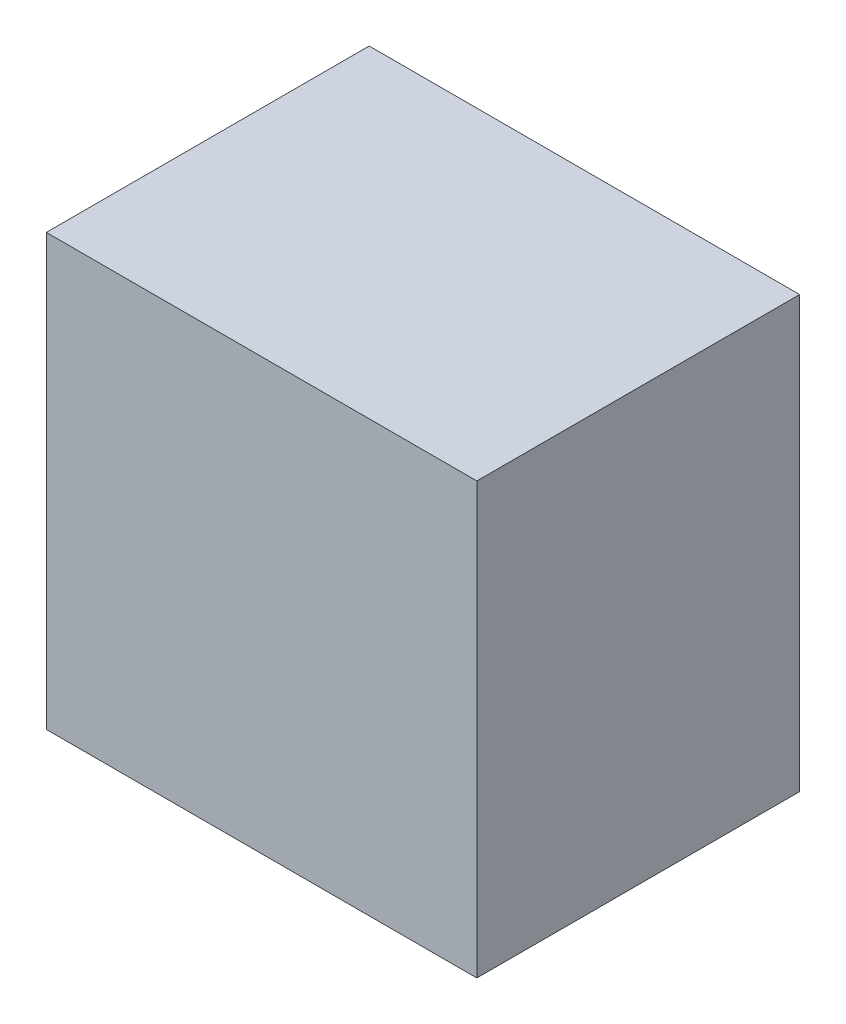
ISO-10303-21;
HEADER;
FILE_DESCRIPTION(('STEP AP214'),'2;1');
FILE_NAME('part.step','',(''),(''),'','','');
FILE_SCHEMA(('AUTOMOTIVE_DESIGN { 1 0 10303 214 1 1 1 1 }'));
ENDSEC;
DATA;
#1=APPLICATION_CONTEXT('core data for automotive mechanical design processes');
#2=APPLICATION_PROTOCOL_DEFINITION('international standard','automotive_design',2000,#1);
#3=PRODUCT_CONTEXT('',#1,'mechanical');
#4=PRODUCT('Part','Part','',(#3));
#5=PRODUCT_RELATED_PRODUCT_CATEGORY('part','',(#4));
#6=PRODUCT_DEFINITION_FORMATION('','',#4);
#7=PRODUCT_DEFINITION_CONTEXT('part definition',#1,'design');
#8=PRODUCT_DEFINITION('design','',#6,#7);
#9=PRODUCT_DEFINITION_SHAPE('','',#8);
#10=(LENGTH_UNIT() NAMED_UNIT(*) SI_UNIT(.MILLI.,.METRE.));
#11=(NAMED_UNIT(*) PLANE_ANGLE_UNIT() SI_UNIT($,.RADIAN.));
#12=(NAMED_UNIT(*) SI_UNIT($,.STERADIAN.) SOLID_ANGLE_UNIT());
#13=UNCERTAINTY_MEASURE_WITH_UNIT(LENGTH_MEASURE(1.E-05),#10,'distance_accuracy_value','');
#14=(GEOMETRIC_REPRESENTATION_CONTEXT(3) GLOBAL_UNCERTAINTY_ASSIGNED_CONTEXT((#13)) GLOBAL_UNIT_ASSIGNED_CONTEXT((#10,
#11,#12)) REPRESENTATION_CONTEXT('',''));
#15=CARTESIAN_POINT('',(0.,0.,0.));
#16=DIRECTION('',(0.,0.,1.));
#17=DIRECTION('',(1.,0.,0.));
#18=AXIS2_PLACEMENT_3D('',#15,#16,#17);
#19=CARTESIAN_POINT('',(0.,25.4,0.));
#20=DIRECTION('',(1.,0.,0.));
#21=DIRECTION('',(0.,0.,-1.));
#22=AXIS2_PLACEMENT_3D('',#19,#20,#21);
#23=PLANE('',#22);
#24=DIRECTION('',(0.,0.,1.));
#25=VECTOR('',#24,1.);
#26=CARTESIAN_POINT('',(0.,0.,0.));
#27=LINE('',#26,#25);
#28=CARTESIAN_POINT('',(0.,0.,-19.05));
#29=VERTEX_POINT('',#28);
#30=CARTESIAN_POINT('',(0.,0.,0.));
#31=VERTEX_POINT('',#30);
#32=EDGE_CURVE('E96',#29,#31,#27,.T.);
#33=ORIENTED_EDGE('',*,*,#32,.T.);
#34=DIRECTION('',(0.,-1.,0.));
#35=VECTOR('',#34,1.);
#36=CARTESIAN_POINT('',(0.,25.4,0.));
#37=LINE('',#36,#35);
#38=CARTESIAN_POINT('',(0.,25.4,0.));
#39=VERTEX_POINT('',#38);
#40=EDGE_CURVE('E11',#39,#31,#37,.T.);
#41=ORIENTED_EDGE('',*,*,#40,.F.);
#42=DIRECTION('',(0.,0.,1.));
#43=VECTOR('',#42,1.);
#44=CARTESIAN_POINT('',(0.,25.4,0.));
#45=LINE('',#44,#43);
#46=CARTESIAN_POINT('',(0.,25.4,-19.05));
#47=VERTEX_POINT('',#46);
#48=EDGE_CURVE('E84',#47,#39,#45,.T.);
#49=ORIENTED_EDGE('',*,*,#48,.F.);
#50=DIRECTION('',(0.,-1.,0.));
#51=VECTOR('',#50,1.);
#52=CARTESIAN_POINT('',(0.,25.4,-19.05));
#53=LINE('',#52,#51);
#54=EDGE_CURVE('E92',#47,#29,#53,.T.);
#55=ORIENTED_EDGE('',*,*,#54,.T.);
#56=EDGE_LOOP('',(#33,#41,#49,#55));
#57=FACE_BOUND('',#56,.T.);
#58=ADVANCED_FACE('F33',(#57),#23,.F.);
#59=CARTESIAN_POINT('',(0.,25.4,0.));
#60=DIRECTION('',(0.,0.,-1.));
#61=DIRECTION('',(-1.,0.,0.));
#62=AXIS2_PLACEMENT_3D('',#59,#60,#61);
#63=PLANE('',#62);
#64=DIRECTION('',(1.,0.,0.));
#65=VECTOR('',#64,1.);
#66=CARTESIAN_POINT('',(0.,0.,0.));
#67=LINE('',#66,#65);
#68=CARTESIAN_POINT('',(25.4,0.,0.));
#69=VERTEX_POINT('',#68);
#70=EDGE_CURVE('E88',#31,#69,#67,.T.);
#71=ORIENTED_EDGE('',*,*,#70,.T.);
#72=DIRECTION('',(0.,-1.,0.));
#73=VECTOR('',#72,1.);
#74=CARTESIAN_POINT('',(25.4,25.4,0.));
#75=LINE('',#74,#73);
#76=CARTESIAN_POINT('',(25.4,25.4,0.));
#77=VERTEX_POINT('',#76);
#78=EDGE_CURVE('E41',#77,#69,#75,.T.);
#79=ORIENTED_EDGE('',*,*,#78,.F.);
#80=DIRECTION('',(1.,0.,0.));
#81=VECTOR('',#80,1.);
#82=CARTESIAN_POINT('',(0.,25.4,0.));
#83=LINE('',#82,#81);
#84=EDGE_CURVE('E79',#39,#77,#83,.T.);
#85=ORIENTED_EDGE('',*,*,#84,.F.);
#86=ORIENTED_EDGE('',*,*,#40,.T.);
#87=EDGE_LOOP('',(#71,#79,#85,#86));
#88=FACE_BOUND('',#87,.T.);
#89=ADVANCED_FACE('F87',(#88),#63,.F.);
#90=CARTESIAN_POINT('',(25.4,25.4,0.));
#91=DIRECTION('',(-1.,0.,0.));
#92=DIRECTION('',(0.,0.,1.));
#93=AXIS2_PLACEMENT_3D('',#90,#91,#92);
#94=PLANE('',#93);
#95=DIRECTION('',(0.,0.,-1.));
#96=VECTOR('',#95,1.);
#97=CARTESIAN_POINT('',(25.4,0.,0.));
#98=LINE('',#97,#96);
#99=CARTESIAN_POINT('',(25.4,0.,-19.05));
#100=VERTEX_POINT('',#99);
#101=EDGE_CURVE('E66',#69,#100,#98,.T.);
#102=ORIENTED_EDGE('',*,*,#101,.T.);
#103=DIRECTION('',(0.,-1.,0.));
#104=VECTOR('',#103,1.);
#105=CARTESIAN_POINT('',(25.4,25.4,-19.05));
#106=LINE('',#105,#104);
#107=CARTESIAN_POINT('',(25.4,25.4,-19.05));
#108=VERTEX_POINT('',#107);
#109=EDGE_CURVE('E89',#108,#100,#106,.T.);
#110=ORIENTED_EDGE('',*,*,#109,.F.);
#111=DIRECTION('',(0.,0.,-1.));
#112=VECTOR('',#111,1.);
#113=CARTESIAN_POINT('',(25.4,25.4,0.));
#114=LINE('',#113,#112);
#115=EDGE_CURVE('E82',#77,#108,#114,.T.);
#116=ORIENTED_EDGE('',*,*,#115,.F.);
#117=ORIENTED_EDGE('',*,*,#78,.T.);
#118=EDGE_LOOP('',(#102,#110,#116,#117));
#119=FACE_BOUND('',#118,.T.);
#120=ADVANCED_FACE('F90',(#119),#94,.F.);
#121=CARTESIAN_POINT('',(0.,25.4,-19.05));
#122=DIRECTION('',(0.,0.,1.));
#123=DIRECTION('',(1.,0.,0.));
#124=AXIS2_PLACEMENT_3D('',#121,#122,#123);
#125=PLANE('',#124);
#126=DIRECTION('',(-1.,0.,0.));
#127=VECTOR('',#126,1.);
#128=CARTESIAN_POINT('',(0.,0.,-19.05));
#129=LINE('',#128,#127);
#130=EDGE_CURVE('E72',#100,#29,#129,.T.);
#131=ORIENTED_EDGE('',*,*,#130,.T.);
#132=ORIENTED_EDGE('',*,*,#54,.F.);
#133=DIRECTION('',(-1.,0.,0.));
#134=VECTOR('',#133,1.);
#135=CARTESIAN_POINT('',(0.,25.4,-19.05));
#136=LINE('',#135,#134);
#137=EDGE_CURVE('E49',#108,#47,#136,.T.);
#138=ORIENTED_EDGE('',*,*,#137,.F.);
#139=ORIENTED_EDGE('',*,*,#109,.T.);
#140=EDGE_LOOP('',(#131,#132,#138,#139));
#141=FACE_BOUND('',#140,.T.);
#142=ADVANCED_FACE('F103',(#141),#125,.F.);
#143=CARTESIAN_POINT('',(0.,25.4,0.));
#144=DIRECTION('',(0.,-1.,0.));
#145=DIRECTION('',(0.,0.,-1.));
#146=AXIS2_PLACEMENT_3D('',#143,#144,#145);
#147=PLANE('',#146);
#148=ORIENTED_EDGE('',*,*,#48,.T.);
#149=ORIENTED_EDGE('',*,*,#84,.T.);
#150=ORIENTED_EDGE('',*,*,#115,.T.);
#151=ORIENTED_EDGE('',*,*,#137,.T.);
#152=EDGE_LOOP('',(#148,#149,#150,#151));
#153=FACE_BOUND('',#152,.T.);
#154=ADVANCED_FACE('F80',(#153),#147,.F.);
#155=CARTESIAN_POINT('',(0.,0.,0.));
#156=DIRECTION('',(0.,-1.,0.));
#157=DIRECTION('',(0.,0.,-1.));
#158=AXIS2_PLACEMENT_3D('',#155,#156,#157);
#159=PLANE('',#158);
#160=ORIENTED_EDGE('',*,*,#32,.F.);
#161=ORIENTED_EDGE('',*,*,#130,.F.);
#162=ORIENTED_EDGE('',*,*,#101,.F.);
#163=ORIENTED_EDGE('',*,*,#70,.F.);
#164=EDGE_LOOP('',(#160,#161,#162,#163));
#165=FACE_BOUND('',#164,.T.);
#166=ADVANCED_FACE('F106',(#165),#159,.T.);
#167=CLOSED_SHELL('',(#58,#89,#120,#142,#154,#166));
#168=MANIFOLD_SOLID_BREP('B2',#167);
#169=ADVANCED_BREP_SHAPE_REPRESENTATION('',(#18,#168),#14);
#170=SHAPE_DEFINITION_REPRESENTATION(#9,#169);
ENDSEC;
END-ISO-10303-21;
